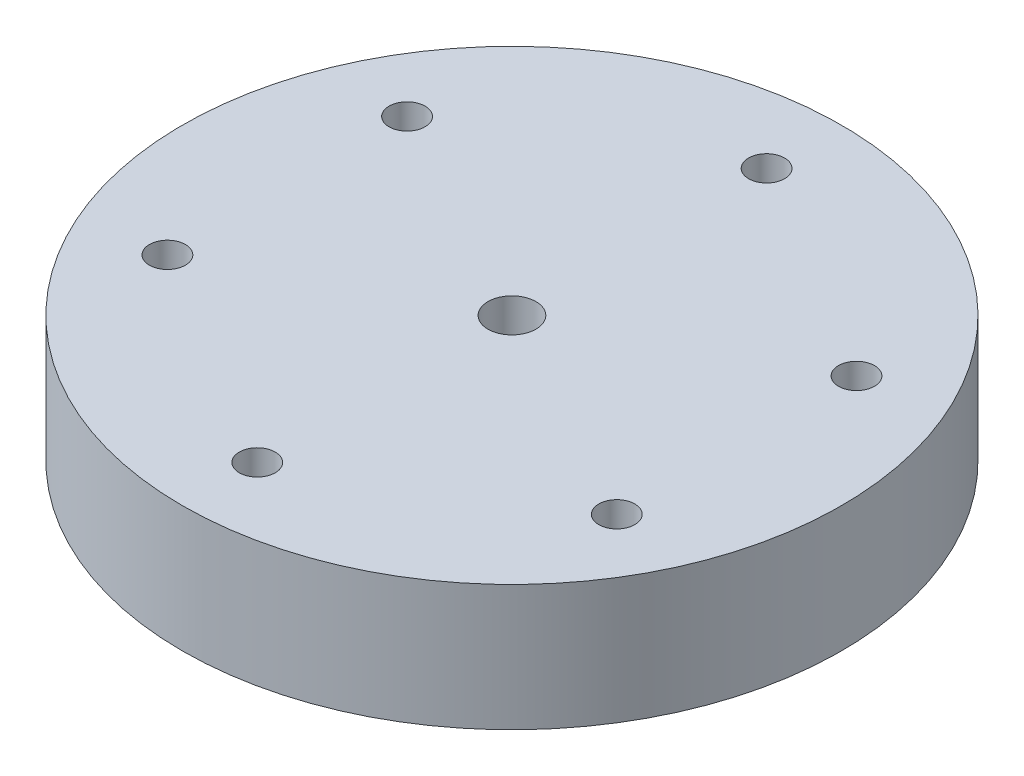
ISO-10303-21;
HEADER;
FILE_DESCRIPTION(('STEP AP214'),'2;1');
FILE_NAME('part.step','',(''),(''),'','','');
FILE_SCHEMA(('AUTOMOTIVE_DESIGN { 1 0 10303 214 1 1 1 1 }'));
ENDSEC;
DATA;
#1=APPLICATION_CONTEXT('core data for automotive mechanical design processes');
#2=APPLICATION_PROTOCOL_DEFINITION('international standard','automotive_design',2000,#1);
#3=PRODUCT_CONTEXT('',#1,'mechanical');
#4=PRODUCT('Part','Part','',(#3));
#5=PRODUCT_RELATED_PRODUCT_CATEGORY('part','',(#4));
#6=PRODUCT_DEFINITION_FORMATION('','',#4);
#7=PRODUCT_DEFINITION_CONTEXT('part definition',#1,'design');
#8=PRODUCT_DEFINITION('design','',#6,#7);
#9=PRODUCT_DEFINITION_SHAPE('','',#8);
#10=(LENGTH_UNIT() NAMED_UNIT(*) SI_UNIT(.MILLI.,.METRE.));
#11=(NAMED_UNIT(*) PLANE_ANGLE_UNIT() SI_UNIT($,.RADIAN.));
#12=(NAMED_UNIT(*) SI_UNIT($,.STERADIAN.) SOLID_ANGLE_UNIT());
#13=UNCERTAINTY_MEASURE_WITH_UNIT(LENGTH_MEASURE(1.E-05),#10,'distance_accuracy_value','');
#14=(GEOMETRIC_REPRESENTATION_CONTEXT(3) GLOBAL_UNCERTAINTY_ASSIGNED_CONTEXT((#13)) GLOBAL_UNIT_ASSIGNED_CONTEXT((#10,
#11,#12)) REPRESENTATION_CONTEXT('',''));
#15=CARTESIAN_POINT('',(0.,0.,0.));
#16=DIRECTION('',(0.,0.,1.));
#17=DIRECTION('',(1.,0.,0.));
#18=AXIS2_PLACEMENT_3D('',#15,#16,#17);
#19=CARTESIAN_POINT('',(37.5,21.,-20.));
#20=DIRECTION('',(0.,-1.,0.));
#21=DIRECTION('',(0.,0.,-1.));
#22=AXIS2_PLACEMENT_3D('',#19,#20,#21);
#23=CYLINDRICAL_SURFACE('',#22,3.);
#24=CARTESIAN_POINT('',(37.5,21.,-20.));
#25=DIRECTION('',(0.,1.,0.));
#26=DIRECTION('',(0.,0.,1.));
#27=AXIS2_PLACEMENT_3D('',#24,#25,#26);
#28=CIRCLE('',#27,3.);
#29=CARTESIAN_POINT('',(37.5,21.,-17.));
#30=VERTEX_POINT('',#29);
#31=EDGE_CURVE('E83',#30,#30,#28,.F.);
#32=ORIENTED_EDGE('',*,*,#31,.F.);
#33=EDGE_LOOP('',(#32));
#34=FACE_BOUND('',#33,.T.);
#35=CARTESIAN_POINT('',(37.5,6.,-20.));
#36=DIRECTION('',(0.,-1.,0.));
#37=DIRECTION('',(0.,0.,-1.));
#38=AXIS2_PLACEMENT_3D('',#35,#36,#37);
#39=CIRCLE('',#38,3.);
#40=CARTESIAN_POINT('',(37.5,6.,-23.));
#41=VERTEX_POINT('',#40);
#42=EDGE_CURVE('E38',#41,#41,#39,.F.);
#43=ORIENTED_EDGE('',*,*,#42,.F.);
#44=EDGE_LOOP('',(#43));
#45=FACE_BOUND('',#44,.T.);
#46=ADVANCED_FACE('F34',(#34,#45),#23,.F.);
#47=CARTESIAN_POINT('',(-37.5,21.,20.));
#48=DIRECTION('',(0.,-1.,0.));
#49=DIRECTION('',(0.,0.,-1.));
#50=AXIS2_PLACEMENT_3D('',#47,#48,#49);
#51=CYLINDRICAL_SURFACE('',#50,3.);
#52=CARTESIAN_POINT('',(-37.5,21.,20.));
#53=DIRECTION('',(0.,1.,0.));
#54=DIRECTION('',(0.,0.,1.));
#55=AXIS2_PLACEMENT_3D('',#52,#53,#54);
#56=CIRCLE('',#55,3.);
#57=CARTESIAN_POINT('',(-37.5,21.,23.));
#58=VERTEX_POINT('',#57);
#59=EDGE_CURVE('E221',#58,#58,#56,.F.);
#60=ORIENTED_EDGE('',*,*,#59,.F.);
#61=EDGE_LOOP('',(#60));
#62=FACE_BOUND('',#61,.T.);
#63=CARTESIAN_POINT('',(-37.5,6.,20.));
#64=DIRECTION('',(0.,-1.,0.));
#65=DIRECTION('',(0.,0.,-1.));
#66=AXIS2_PLACEMENT_3D('',#63,#64,#65);
#67=CIRCLE('',#66,3.);
#68=CARTESIAN_POINT('',(-37.5,6.,17.));
#69=VERTEX_POINT('',#68);
#70=EDGE_CURVE('E63',#69,#69,#67,.F.);
#71=ORIENTED_EDGE('',*,*,#70,.F.);
#72=EDGE_LOOP('',(#71));
#73=FACE_BOUND('',#72,.T.);
#74=ADVANCED_FACE('F109',(#62,#73),#51,.F.);
#75=CARTESIAN_POINT('',(0.,21.,0.));
#76=DIRECTION('',(0.,1.,0.));
#77=DIRECTION('',(0.,0.,1.));
#78=AXIS2_PLACEMENT_3D('',#75,#76,#77);
#79=PLANE('',#78);
#80=CARTESIAN_POINT('',(0.,21.,-42.5));
#81=DIRECTION('',(0.,1.,0.));
#82=DIRECTION('',(0.,0.,1.));
#83=AXIS2_PLACEMENT_3D('',#80,#81,#82);
#84=CIRCLE('',#83,3.);
#85=CARTESIAN_POINT('',(0.,21.,-39.5));
#86=VERTEX_POINT('',#85);
#87=EDGE_CURVE('E74',#86,#86,#84,.T.);
#88=ORIENTED_EDGE('',*,*,#87,.F.);
#89=EDGE_LOOP('',(#88));
#90=FACE_BOUND('',#89,.T.);
#91=CARTESIAN_POINT('',(37.5,21.,20.));
#92=DIRECTION('',(0.,1.,0.));
#93=DIRECTION('',(0.,0.,1.));
#94=AXIS2_PLACEMENT_3D('',#91,#92,#93);
#95=CIRCLE('',#94,3.);
#96=CARTESIAN_POINT('',(37.5,21.,23.));
#97=VERTEX_POINT('',#96);
#98=EDGE_CURVE('E85',#97,#97,#95,.T.);
#99=ORIENTED_EDGE('',*,*,#98,.F.);
#100=EDGE_LOOP('',(#99));
#101=FACE_BOUND('',#100,.T.);
#102=ORIENTED_EDGE('',*,*,#31,.T.);
#103=EDGE_LOOP('',(#102));
#104=FACE_BOUND('',#103,.T.);
#105=CARTESIAN_POINT('',(0.,21.,0.));
#106=DIRECTION('',(0.,1.,0.));
#107=DIRECTION('',(0.,0.,1.));
#108=AXIS2_PLACEMENT_3D('',#105,#106,#107);
#109=CIRCLE('',#108,55.);
#110=CARTESIAN_POINT('',(0.,21.,55.));
#111=VERTEX_POINT('',#110);
#112=EDGE_CURVE('E10',#111,#111,#109,.T.);
#113=ORIENTED_EDGE('',*,*,#112,.T.);
#114=EDGE_LOOP('',(#113));
#115=FACE_BOUND('',#114,.T.);
#116=CARTESIAN_POINT('',(0.,21.,0.));
#117=DIRECTION('',(0.,1.,0.));
#118=DIRECTION('',(0.,0.,1.));
#119=AXIS2_PLACEMENT_3D('',#116,#117,#118);
#120=CIRCLE('',#119,4.);
#121=CARTESIAN_POINT('',(0.,21.,4.));
#122=VERTEX_POINT('',#121);
#123=EDGE_CURVE('E47',#122,#122,#120,.T.);
#124=ORIENTED_EDGE('',*,*,#123,.F.);
#125=EDGE_LOOP('',(#124));
#126=FACE_BOUND('',#125,.T.);
#127=ORIENTED_EDGE('',*,*,#59,.T.);
#128=EDGE_LOOP('',(#127));
#129=FACE_BOUND('',#128,.T.);
#130=CARTESIAN_POINT('',(-37.5,21.,-20.));
#131=DIRECTION('',(0.,1.,0.));
#132=DIRECTION('',(0.,0.,1.));
#133=AXIS2_PLACEMENT_3D('',#130,#131,#132);
#134=CIRCLE('',#133,3.);
#135=CARTESIAN_POINT('',(-37.5,21.,-17.));
#136=VERTEX_POINT('',#135);
#137=EDGE_CURVE('E79',#136,#136,#134,.T.);
#138=ORIENTED_EDGE('',*,*,#137,.F.);
#139=EDGE_LOOP('',(#138));
#140=FACE_BOUND('',#139,.T.);
#141=CARTESIAN_POINT('',(0.,21.,42.5));
#142=DIRECTION('',(0.,1.,0.));
#143=DIRECTION('',(0.,0.,1.));
#144=AXIS2_PLACEMENT_3D('',#141,#142,#143);
#145=CIRCLE('',#144,3.);
#146=CARTESIAN_POINT('',(0.,21.,45.5));
#147=VERTEX_POINT('',#146);
#148=EDGE_CURVE('E70',#147,#147,#145,.T.);
#149=ORIENTED_EDGE('',*,*,#148,.F.);
#150=EDGE_LOOP('',(#149));
#151=FACE_BOUND('',#150,.T.);
#152=ADVANCED_FACE('F114',(#90,#101,#104,#115,#126,#129,#140,#151),#79,.T.);
#153=CARTESIAN_POINT('',(0.,0.,0.));
#154=DIRECTION('',(0.,1.,0.));
#155=DIRECTION('',(0.,0.,1.));
#156=AXIS2_PLACEMENT_3D('',#153,#154,#155);
#157=PLANE('',#156);
#158=CARTESIAN_POINT('',(0.,0.,42.5));
#159=DIRECTION('',(0.,1.,0.));
#160=DIRECTION('',(0.,0.,1.));
#161=AXIS2_PLACEMENT_3D('',#158,#159,#160);
#162=CIRCLE('',#161,5.);
#163=CARTESIAN_POINT('',(0.,0.,47.5));
#164=VERTEX_POINT('',#163);
#165=EDGE_CURVE('E200',#164,#164,#162,.T.);
#166=ORIENTED_EDGE('',*,*,#165,.T.);
#167=EDGE_LOOP('',(#166));
#168=FACE_BOUND('',#167,.T.);
#169=CARTESIAN_POINT('',(-37.5,0.,20.));
#170=DIRECTION('',(0.,1.,0.));
#171=DIRECTION('',(0.,0.,-1.));
#172=AXIS2_PLACEMENT_3D('',#169,#170,#171);
#173=CIRCLE('',#172,5.);
#174=CARTESIAN_POINT('',(-37.5,0.,15.));
#175=VERTEX_POINT('',#174);
#176=EDGE_CURVE('E201',#175,#175,#173,.T.);
#177=ORIENTED_EDGE('',*,*,#176,.T.);
#178=EDGE_LOOP('',(#177));
#179=FACE_BOUND('',#178,.T.);
#180=CARTESIAN_POINT('',(37.5,0.,-20.));
#181=DIRECTION('',(0.,1.,0.));
#182=DIRECTION('',(0.,0.,-1.));
#183=AXIS2_PLACEMENT_3D('',#180,#181,#182);
#184=CIRCLE('',#183,5.);
#185=CARTESIAN_POINT('',(37.5,0.,-25.));
#186=VERTEX_POINT('',#185);
#187=EDGE_CURVE('E190',#186,#186,#184,.T.);
#188=ORIENTED_EDGE('',*,*,#187,.T.);
#189=EDGE_LOOP('',(#188));
#190=FACE_BOUND('',#189,.T.);
#191=CARTESIAN_POINT('',(37.5,0.,20.));
#192=DIRECTION('',(0.,1.,0.));
#193=DIRECTION('',(0.,0.,1.));
#194=AXIS2_PLACEMENT_3D('',#191,#192,#193);
#195=CIRCLE('',#194,5.);
#196=CARTESIAN_POINT('',(37.5,0.,25.));
#197=VERTEX_POINT('',#196);
#198=EDGE_CURVE('E185',#197,#197,#195,.T.);
#199=ORIENTED_EDGE('',*,*,#198,.T.);
#200=EDGE_LOOP('',(#199));
#201=FACE_BOUND('',#200,.T.);
#202=CARTESIAN_POINT('',(0.,0.,-42.5));
#203=DIRECTION('',(0.,1.,0.));
#204=DIRECTION('',(0.,0.,1.));
#205=AXIS2_PLACEMENT_3D('',#202,#203,#204);
#206=CIRCLE('',#205,5.);
#207=CARTESIAN_POINT('',(0.,0.,-37.5));
#208=VERTEX_POINT('',#207);
#209=EDGE_CURVE('E192',#208,#208,#206,.T.);
#210=ORIENTED_EDGE('',*,*,#209,.T.);
#211=EDGE_LOOP('',(#210));
#212=FACE_BOUND('',#211,.T.);
#213=CARTESIAN_POINT('',(-37.5,0.,-20.));
#214=DIRECTION('',(0.,1.,0.));
#215=DIRECTION('',(0.,0.,1.));
#216=AXIS2_PLACEMENT_3D('',#213,#214,#215);
#217=CIRCLE('',#216,5.);
#218=CARTESIAN_POINT('',(-37.5,0.,-15.));
#219=VERTEX_POINT('',#218);
#220=EDGE_CURVE('E204',#219,#219,#217,.T.);
#221=ORIENTED_EDGE('',*,*,#220,.T.);
#222=EDGE_LOOP('',(#221));
#223=FACE_BOUND('',#222,.T.);
#224=CARTESIAN_POINT('',(0.,0.,0.));
#225=DIRECTION('',(0.,1.,0.));
#226=DIRECTION('',(0.,0.,1.));
#227=AXIS2_PLACEMENT_3D('',#224,#225,#226);
#228=CIRCLE('',#227,55.);
#229=CARTESIAN_POINT('',(0.,0.,55.));
#230=VERTEX_POINT('',#229);
#231=EDGE_CURVE('E42',#230,#230,#228,.T.);
#232=ORIENTED_EDGE('',*,*,#231,.F.);
#233=EDGE_LOOP('',(#232));
#234=FACE_BOUND('',#233,.T.);
#235=CARTESIAN_POINT('',(0.,0.,0.));
#236=DIRECTION('',(0.,1.,0.));
#237=DIRECTION('',(0.,0.,1.));
#238=AXIS2_PLACEMENT_3D('',#235,#236,#237);
#239=CIRCLE('',#238,4.);
#240=CARTESIAN_POINT('',(0.,0.,4.));
#241=VERTEX_POINT('',#240);
#242=EDGE_CURVE('E50',#241,#241,#239,.T.);
#243=ORIENTED_EDGE('',*,*,#242,.T.);
#244=EDGE_LOOP('',(#243));
#245=FACE_BOUND('',#244,.T.);
#246=ADVANCED_FACE('F92',(#168,#179,#190,#201,#212,#223,#234,#245),#157,.F.);
#247=CARTESIAN_POINT('',(0.,21.,0.));
#248=DIRECTION('',(0.,-1.,0.));
#249=DIRECTION('',(0.,0.,-1.));
#250=AXIS2_PLACEMENT_3D('',#247,#248,#249);
#251=CYLINDRICAL_SURFACE('',#250,55.);
#252=ORIENTED_EDGE('',*,*,#112,.F.);
#253=EDGE_LOOP('',(#252));
#254=FACE_BOUND('',#253,.T.);
#255=ORIENTED_EDGE('',*,*,#231,.T.);
#256=EDGE_LOOP('',(#255));
#257=FACE_BOUND('',#256,.T.);
#258=ADVANCED_FACE('F36',(#254,#257),#251,.T.);
#259=CARTESIAN_POINT('',(0.,21.,0.));
#260=DIRECTION('',(0.,-1.,0.));
#261=DIRECTION('',(0.,0.,-1.));
#262=AXIS2_PLACEMENT_3D('',#259,#260,#261);
#263=CYLINDRICAL_SURFACE('',#262,4.);
#264=ORIENTED_EDGE('',*,*,#123,.T.);
#265=EDGE_LOOP('',(#264));
#266=FACE_BOUND('',#265,.T.);
#267=ORIENTED_EDGE('',*,*,#242,.F.);
#268=EDGE_LOOP('',(#267));
#269=FACE_BOUND('',#268,.T.);
#270=ADVANCED_FACE('F94',(#266,#269),#263,.F.);
#271=CARTESIAN_POINT('',(37.5,21.,20.));
#272=DIRECTION('',(0.,-1.,0.));
#273=DIRECTION('',(0.,0.,-1.));
#274=AXIS2_PLACEMENT_3D('',#271,#272,#273);
#275=CYLINDRICAL_SURFACE('',#274,3.);
#276=CARTESIAN_POINT('',(37.5,6.,20.));
#277=DIRECTION('',(0.,1.,0.));
#278=DIRECTION('',(0.,0.,1.));
#279=AXIS2_PLACEMENT_3D('',#276,#277,#278);
#280=CIRCLE('',#279,3.);
#281=CARTESIAN_POINT('',(37.5,6.,23.));
#282=VERTEX_POINT('',#281);
#283=EDGE_CURVE('E65',#282,#282,#280,.T.);
#284=ORIENTED_EDGE('',*,*,#283,.F.);
#285=EDGE_LOOP('',(#284));
#286=FACE_BOUND('',#285,.T.);
#287=ORIENTED_EDGE('',*,*,#98,.T.);
#288=EDGE_LOOP('',(#287));
#289=FACE_BOUND('',#288,.T.);
#290=ADVANCED_FACE('F96',(#286,#289),#275,.F.);
#291=CARTESIAN_POINT('',(-37.5,21.,-20.));
#292=DIRECTION('',(0.,-1.,0.));
#293=DIRECTION('',(0.,0.,-1.));
#294=AXIS2_PLACEMENT_3D('',#291,#292,#293);
#295=CYLINDRICAL_SURFACE('',#294,3.);
#296=CARTESIAN_POINT('',(-37.5,6.,-20.));
#297=DIRECTION('',(0.,1.,0.));
#298=DIRECTION('',(0.,0.,1.));
#299=AXIS2_PLACEMENT_3D('',#296,#297,#298);
#300=CIRCLE('',#299,3.);
#301=CARTESIAN_POINT('',(-37.5,6.,-17.));
#302=VERTEX_POINT('',#301);
#303=EDGE_CURVE('E60',#302,#302,#300,.T.);
#304=ORIENTED_EDGE('',*,*,#303,.F.);
#305=EDGE_LOOP('',(#304));
#306=FACE_BOUND('',#305,.T.);
#307=ORIENTED_EDGE('',*,*,#137,.T.);
#308=EDGE_LOOP('',(#307));
#309=FACE_BOUND('',#308,.T.);
#310=ADVANCED_FACE('F102',(#306,#309),#295,.F.);
#311=CARTESIAN_POINT('',(0.,21.,-42.5));
#312=DIRECTION('',(0.,-1.,0.));
#313=DIRECTION('',(0.,0.,-1.));
#314=AXIS2_PLACEMENT_3D('',#311,#312,#313);
#315=CYLINDRICAL_SURFACE('',#314,3.);
#316=CARTESIAN_POINT('',(0.,6.,-42.5));
#317=DIRECTION('',(0.,1.,0.));
#318=DIRECTION('',(0.,0.,1.));
#319=AXIS2_PLACEMENT_3D('',#316,#317,#318);
#320=CIRCLE('',#319,3.);
#321=CARTESIAN_POINT('',(0.,6.,-39.5));
#322=VERTEX_POINT('',#321);
#323=EDGE_CURVE('E56',#322,#322,#320,.T.);
#324=ORIENTED_EDGE('',*,*,#323,.F.);
#325=EDGE_LOOP('',(#324));
#326=FACE_BOUND('',#325,.T.);
#327=ORIENTED_EDGE('',*,*,#87,.T.);
#328=EDGE_LOOP('',(#327));
#329=FACE_BOUND('',#328,.T.);
#330=ADVANCED_FACE('F124',(#326,#329),#315,.F.);
#331=CARTESIAN_POINT('',(0.,21.,42.5));
#332=DIRECTION('',(0.,-1.,0.));
#333=DIRECTION('',(0.,0.,-1.));
#334=AXIS2_PLACEMENT_3D('',#331,#332,#333);
#335=CYLINDRICAL_SURFACE('',#334,3.);
#336=CARTESIAN_POINT('',(0.,6.,42.5));
#337=DIRECTION('',(0.,1.,0.));
#338=DIRECTION('',(0.,0.,1.));
#339=AXIS2_PLACEMENT_3D('',#336,#337,#338);
#340=CIRCLE('',#339,3.);
#341=CARTESIAN_POINT('',(0.,6.,45.5));
#342=VERTEX_POINT('',#341);
#343=EDGE_CURVE('E53',#342,#342,#340,.T.);
#344=ORIENTED_EDGE('',*,*,#343,.F.);
#345=EDGE_LOOP('',(#344));
#346=FACE_BOUND('',#345,.T.);
#347=ORIENTED_EDGE('',*,*,#148,.T.);
#348=EDGE_LOOP('',(#347));
#349=FACE_BOUND('',#348,.T.);
#350=ADVANCED_FACE('F120',(#346,#349),#335,.F.);
#351=CARTESIAN_POINT('',(0.,6.,42.5));
#352=DIRECTION('',(0.,-1.,0.));
#353=DIRECTION('',(0.,0.,-1.));
#354=AXIS2_PLACEMENT_3D('',#351,#352,#353);
#355=CYLINDRICAL_SURFACE('',#354,5.);
#356=CARTESIAN_POINT('',(0.,6.,42.5));
#357=DIRECTION('',(0.,1.,0.));
#358=DIRECTION('',(0.,0.,1.));
#359=AXIS2_PLACEMENT_3D('',#356,#357,#358);
#360=CIRCLE('',#359,5.);
#361=CARTESIAN_POINT('',(0.,6.,47.5));
#362=VERTEX_POINT('',#361);
#363=EDGE_CURVE('E212',#362,#362,#360,.T.);
#364=ORIENTED_EDGE('',*,*,#363,.T.);
#365=EDGE_LOOP('',(#364));
#366=FACE_BOUND('',#365,.T.);
#367=ORIENTED_EDGE('',*,*,#165,.F.);
#368=EDGE_LOOP('',(#367));
#369=FACE_BOUND('',#368,.T.);
#370=ADVANCED_FACE('F123',(#366,#369),#355,.F.);
#371=CARTESIAN_POINT('',(0.,6.,42.5));
#372=DIRECTION('',(0.,1.,0.));
#373=DIRECTION('',(0.,0.,1.));
#374=AXIS2_PLACEMENT_3D('',#371,#372,#373);
#375=PLANE('',#374);
#376=ORIENTED_EDGE('',*,*,#343,.T.);
#377=EDGE_LOOP('',(#376));
#378=FACE_BOUND('',#377,.T.);
#379=ORIENTED_EDGE('',*,*,#363,.F.);
#380=EDGE_LOOP('',(#379));
#381=FACE_BOUND('',#380,.T.);
#382=ADVANCED_FACE('F142',(#378,#381),#375,.F.);
#383=CARTESIAN_POINT('',(0.,6.,-42.5));
#384=DIRECTION('',(0.,-1.,0.));
#385=DIRECTION('',(0.,0.,-1.));
#386=AXIS2_PLACEMENT_3D('',#383,#384,#385);
#387=CYLINDRICAL_SURFACE('',#386,5.);
#388=CARTESIAN_POINT('',(0.,6.,-42.5));
#389=DIRECTION('',(0.,1.,0.));
#390=DIRECTION('',(0.,0.,1.));
#391=AXIS2_PLACEMENT_3D('',#388,#389,#390);
#392=CIRCLE('',#391,5.);
#393=CARTESIAN_POINT('',(0.,6.,-37.5));
#394=VERTEX_POINT('',#393);
#395=EDGE_CURVE('E197',#394,#394,#392,.T.);
#396=ORIENTED_EDGE('',*,*,#395,.T.);
#397=EDGE_LOOP('',(#396));
#398=FACE_BOUND('',#397,.T.);
#399=ORIENTED_EDGE('',*,*,#209,.F.);
#400=EDGE_LOOP('',(#399));
#401=FACE_BOUND('',#400,.T.);
#402=ADVANCED_FACE('F145',(#398,#401),#387,.F.);
#403=CARTESIAN_POINT('',(0.,6.,-42.5));
#404=DIRECTION('',(0.,1.,0.));
#405=DIRECTION('',(0.,0.,1.));
#406=AXIS2_PLACEMENT_3D('',#403,#404,#405);
#407=PLANE('',#406);
#408=ORIENTED_EDGE('',*,*,#323,.T.);
#409=EDGE_LOOP('',(#408));
#410=FACE_BOUND('',#409,.T.);
#411=ORIENTED_EDGE('',*,*,#395,.F.);
#412=EDGE_LOOP('',(#411));
#413=FACE_BOUND('',#412,.T.);
#414=ADVANCED_FACE('F136',(#410,#413),#407,.F.);
#415=CARTESIAN_POINT('',(-37.5,6.,-20.));
#416=DIRECTION('',(0.,-1.,0.));
#417=DIRECTION('',(0.,0.,-1.));
#418=AXIS2_PLACEMENT_3D('',#415,#416,#417);
#419=CYLINDRICAL_SURFACE('',#418,5.);
#420=CARTESIAN_POINT('',(-37.5,6.,-20.));
#421=DIRECTION('',(0.,1.,0.));
#422=DIRECTION('',(0.,0.,1.));
#423=AXIS2_PLACEMENT_3D('',#420,#421,#422);
#424=CIRCLE('',#423,5.);
#425=CARTESIAN_POINT('',(-37.5,6.,-15.));
#426=VERTEX_POINT('',#425);
#427=EDGE_CURVE('E57',#426,#426,#424,.T.);
#428=ORIENTED_EDGE('',*,*,#427,.T.);
#429=EDGE_LOOP('',(#428));
#430=FACE_BOUND('',#429,.T.);
#431=ORIENTED_EDGE('',*,*,#220,.F.);
#432=EDGE_LOOP('',(#431));
#433=FACE_BOUND('',#432,.T.);
#434=ADVANCED_FACE('F132',(#430,#433),#419,.F.);
#435=CARTESIAN_POINT('',(-37.5,6.,-20.));
#436=DIRECTION('',(0.,1.,0.));
#437=DIRECTION('',(0.,0.,1.));
#438=AXIS2_PLACEMENT_3D('',#435,#436,#437);
#439=PLANE('',#438);
#440=ORIENTED_EDGE('',*,*,#303,.T.);
#441=EDGE_LOOP('',(#440));
#442=FACE_BOUND('',#441,.T.);
#443=ORIENTED_EDGE('',*,*,#427,.F.);
#444=EDGE_LOOP('',(#443));
#445=FACE_BOUND('',#444,.T.);
#446=ADVANCED_FACE('F135',(#442,#445),#439,.F.);
#447=CARTESIAN_POINT('',(-37.5,6.,20.));
#448=DIRECTION('',(0.,-1.,0.));
#449=DIRECTION('',(0.,0.,-1.));
#450=AXIS2_PLACEMENT_3D('',#447,#448,#449);
#451=PLANE('',#450);
#452=CARTESIAN_POINT('',(-37.5,6.,20.));
#453=DIRECTION('',(0.,1.,0.));
#454=DIRECTION('',(0.,0.,-1.));
#455=AXIS2_PLACEMENT_3D('',#452,#453,#454);
#456=CIRCLE('',#455,5.);
#457=CARTESIAN_POINT('',(-37.5,6.,15.));
#458=VERTEX_POINT('',#457);
#459=EDGE_CURVE('E205',#458,#458,#456,.T.);
#460=ORIENTED_EDGE('',*,*,#459,.F.);
#461=EDGE_LOOP('',(#460));
#462=FACE_BOUND('',#461,.T.);
#463=ORIENTED_EDGE('',*,*,#70,.T.);
#464=EDGE_LOOP('',(#463));
#465=FACE_BOUND('',#464,.T.);
#466=ADVANCED_FACE('F140',(#462,#465),#451,.T.);
#467=CARTESIAN_POINT('',(-37.5,6.,20.));
#468=DIRECTION('',(0.,-1.,0.));
#469=DIRECTION('',(0.,0.,-1.));
#470=AXIS2_PLACEMENT_3D('',#467,#468,#469);
#471=CYLINDRICAL_SURFACE('',#470,5.);
#472=ORIENTED_EDGE('',*,*,#459,.T.);
#473=EDGE_LOOP('',(#472));
#474=FACE_BOUND('',#473,.T.);
#475=ORIENTED_EDGE('',*,*,#176,.F.);
#476=EDGE_LOOP('',(#475));
#477=FACE_BOUND('',#476,.T.);
#478=ADVANCED_FACE('F161',(#474,#477),#471,.F.);
#479=CARTESIAN_POINT('',(37.5,6.,20.));
#480=DIRECTION('',(0.,-1.,0.));
#481=DIRECTION('',(0.,0.,-1.));
#482=AXIS2_PLACEMENT_3D('',#479,#480,#481);
#483=CYLINDRICAL_SURFACE('',#482,5.);
#484=CARTESIAN_POINT('',(37.5,6.,20.));
#485=DIRECTION('',(0.,1.,0.));
#486=DIRECTION('',(0.,0.,1.));
#487=AXIS2_PLACEMENT_3D('',#484,#485,#486);
#488=CIRCLE('',#487,5.);
#489=CARTESIAN_POINT('',(37.5,6.,25.));
#490=VERTEX_POINT('',#489);
#491=EDGE_CURVE('E182',#490,#490,#488,.T.);
#492=ORIENTED_EDGE('',*,*,#491,.T.);
#493=EDGE_LOOP('',(#492));
#494=FACE_BOUND('',#493,.T.);
#495=ORIENTED_EDGE('',*,*,#198,.F.);
#496=EDGE_LOOP('',(#495));
#497=FACE_BOUND('',#496,.T.);
#498=ADVANCED_FACE('F165',(#494,#497),#483,.F.);
#499=CARTESIAN_POINT('',(37.5,6.,20.));
#500=DIRECTION('',(0.,1.,0.));
#501=DIRECTION('',(0.,0.,1.));
#502=AXIS2_PLACEMENT_3D('',#499,#500,#501);
#503=PLANE('',#502);
#504=ORIENTED_EDGE('',*,*,#283,.T.);
#505=EDGE_LOOP('',(#504));
#506=FACE_BOUND('',#505,.T.);
#507=ORIENTED_EDGE('',*,*,#491,.F.);
#508=EDGE_LOOP('',(#507));
#509=FACE_BOUND('',#508,.T.);
#510=ADVANCED_FACE('F154',(#506,#509),#503,.F.);
#511=CARTESIAN_POINT('',(37.5,6.,-20.));
#512=DIRECTION('',(0.,-1.,0.));
#513=DIRECTION('',(0.,0.,-1.));
#514=AXIS2_PLACEMENT_3D('',#511,#512,#513);
#515=PLANE('',#514);
#516=CARTESIAN_POINT('',(37.5,6.,-20.));
#517=DIRECTION('',(0.,1.,0.));
#518=DIRECTION('',(0.,0.,-1.));
#519=AXIS2_PLACEMENT_3D('',#516,#517,#518);
#520=CIRCLE('',#519,5.);
#521=CARTESIAN_POINT('',(37.5,6.,-25.));
#522=VERTEX_POINT('',#521);
#523=EDGE_CURVE('E187',#522,#522,#520,.T.);
#524=ORIENTED_EDGE('',*,*,#523,.F.);
#525=EDGE_LOOP('',(#524));
#526=FACE_BOUND('',#525,.T.);
#527=ORIENTED_EDGE('',*,*,#42,.T.);
#528=EDGE_LOOP('',(#527));
#529=FACE_BOUND('',#528,.T.);
#530=ADVANCED_FACE('F150',(#526,#529),#515,.T.);
#531=CARTESIAN_POINT('',(37.5,6.,-20.));
#532=DIRECTION('',(0.,-1.,0.));
#533=DIRECTION('',(0.,0.,-1.));
#534=AXIS2_PLACEMENT_3D('',#531,#532,#533);
#535=CYLINDRICAL_SURFACE('',#534,5.);
#536=ORIENTED_EDGE('',*,*,#523,.T.);
#537=EDGE_LOOP('',(#536));
#538=FACE_BOUND('',#537,.T.);
#539=ORIENTED_EDGE('',*,*,#187,.F.);
#540=EDGE_LOOP('',(#539));
#541=FACE_BOUND('',#540,.T.);
#542=ADVANCED_FACE('F153',(#538,#541),#535,.F.);
#543=CLOSED_SHELL('',(#46,#74,#152,#246,#258,#270,#290,#310,#330,#350,#370,#382,#402,#414,#434,
#446,#466,#478,#498,#510,#530,#542));
#544=MANIFOLD_SOLID_BREP('B2',#543);
#545=ADVANCED_BREP_SHAPE_REPRESENTATION('',(#18,#544),#14);
#546=SHAPE_DEFINITION_REPRESENTATION(#9,#545);
ENDSEC;
END-ISO-10303-21;
